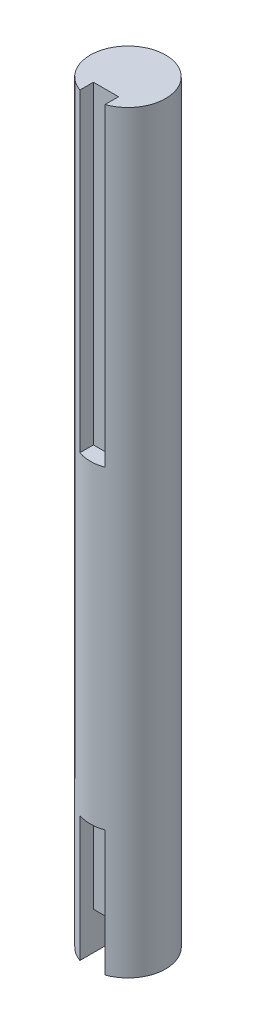
ISO-10303-21;
HEADER;
FILE_DESCRIPTION(('STEP AP214'),'2;1');
FILE_NAME('part.step','',(''),(''),'','','');
FILE_SCHEMA(('AUTOMOTIVE_DESIGN { 1 0 10303 214 1 1 1 1 }'));
ENDSEC;
DATA;
#1=APPLICATION_CONTEXT('core data for automotive mechanical design processes');
#2=APPLICATION_PROTOCOL_DEFINITION('international standard','automotive_design',2000,#1);
#3=PRODUCT_CONTEXT('',#1,'mechanical');
#4=PRODUCT('Part','Part','',(#3));
#5=PRODUCT_RELATED_PRODUCT_CATEGORY('part','',(#4));
#6=PRODUCT_DEFINITION_FORMATION('','',#4);
#7=PRODUCT_DEFINITION_CONTEXT('part definition',#1,'design');
#8=PRODUCT_DEFINITION('design','',#6,#7);
#9=PRODUCT_DEFINITION_SHAPE('','',#8);
#10=(LENGTH_UNIT() NAMED_UNIT(*) SI_UNIT(.MILLI.,.METRE.));
#11=(NAMED_UNIT(*) PLANE_ANGLE_UNIT() SI_UNIT($,.RADIAN.));
#12=(NAMED_UNIT(*) SI_UNIT($,.STERADIAN.) SOLID_ANGLE_UNIT());
#13=UNCERTAINTY_MEASURE_WITH_UNIT(LENGTH_MEASURE(1.E-05),#10,'distance_accuracy_value','');
#14=(GEOMETRIC_REPRESENTATION_CONTEXT(3) GLOBAL_UNCERTAINTY_ASSIGNED_CONTEXT((#13)) GLOBAL_UNIT_ASSIGNED_CONTEXT((#10,
#11,#12)) REPRESENTATION_CONTEXT('',''));
#15=CARTESIAN_POINT('',(0.,0.,0.));
#16=DIRECTION('',(0.,0.,1.));
#17=DIRECTION('',(1.,0.,0.));
#18=AXIS2_PLACEMENT_3D('',#15,#16,#17);
#19=CARTESIAN_POINT('',(0.,-16.,0.));
#20=DIRECTION('',(0.,1.,0.));
#21=DIRECTION('',(0.,0.,1.));
#22=AXIS2_PLACEMENT_3D('',#19,#20,#21);
#23=PLANE('',#22);
#24=DIRECTION('',(0.,0.,1.));
#25=VECTOR('',#24,1.);
#26=CARTESIAN_POINT('',(2.,-16.,0.));
#27=LINE('',#26,#25);
#28=CARTESIAN_POINT('',(2.,-16.,1.));
#29=VERTEX_POINT('',#28);
#30=CARTESIAN_POINT('',(2.,-16.,5.65685424949238));
#31=VERTEX_POINT('',#30);
#32=EDGE_CURVE('E186',#29,#31,#27,.T.);
#33=ORIENTED_EDGE('',*,*,#32,.F.);
#34=DIRECTION('',(-1.,0.,0.));
#35=VECTOR('',#34,1.);
#36=CARTESIAN_POINT('',(0.,-16.,1.));
#37=LINE('',#36,#35);
#38=CARTESIAN_POINT('',(-2.,-16.,0.999999999999999));
#39=VERTEX_POINT('',#38);
#40=EDGE_CURVE('E123',#29,#39,#37,.T.);
#41=ORIENTED_EDGE('',*,*,#40,.T.);
#42=DIRECTION('',(0.,0.,-1.));
#43=VECTOR('',#42,1.);
#44=CARTESIAN_POINT('',(-2.,-16.,0.));
#45=LINE('',#44,#43);
#46=CARTESIAN_POINT('',(-2.,-16.,5.65685424949238));
#47=VERTEX_POINT('',#46);
#48=EDGE_CURVE('E184',#47,#39,#45,.T.);
#49=ORIENTED_EDGE('',*,*,#48,.F.);
#50=CARTESIAN_POINT('',(0.,-16.,0.));
#51=DIRECTION('',(0.,1.,0.));
#52=DIRECTION('',(0.,0.,1.));
#53=AXIS2_PLACEMENT_3D('',#50,#51,#52);
#54=CIRCLE('',#53,6.);
#55=EDGE_CURVE('E181',#31,#47,#54,.T.);
#56=ORIENTED_EDGE('',*,*,#55,.F.);
#57=EDGE_LOOP('',(#33,#41,#49,#56));
#58=FACE_BOUND('',#57,.T.);
#59=ADVANCED_FACE('F38',(#58),#23,.F.);
#60=CARTESIAN_POINT('',(0.,-16.,0.));
#61=DIRECTION('',(0.,1.,0.));
#62=DIRECTION('',(0.,0.,1.));
#63=AXIS2_PLACEMENT_3D('',#60,#61,#62);
#64=CYLINDRICAL_SURFACE('',#63,6.);
#65=CARTESIAN_POINT('',(0.,4.,0.));
#66=DIRECTION('',(0.,1.,0.));
#67=DIRECTION('',(0.,0.,1.));
#68=AXIS2_PLACEMENT_3D('',#65,#66,#67);
#69=CIRCLE('',#68,6.);
#70=CARTESIAN_POINT('',(2.,4.,5.65685424949238));
#71=VERTEX_POINT('',#70);
#72=CARTESIAN_POINT('',(-2.,4.,5.65685424949238));
#73=VERTEX_POINT('',#72);
#74=EDGE_CURVE('E188',#71,#73,#69,.F.);
#75=ORIENTED_EDGE('',*,*,#74,.F.);
#76=DIRECTION('',(0.,1.,0.));
#77=VECTOR('',#76,1.);
#78=CARTESIAN_POINT('',(2.,-16.,5.65685424949238));
#79=LINE('',#78,#77);
#80=EDGE_CURVE('E176',#71,#31,#79,.F.);
#81=ORIENTED_EDGE('',*,*,#80,.T.);
#82=ORIENTED_EDGE('',*,*,#55,.T.);
#83=DIRECTION('',(0.,1.,0.));
#84=VECTOR('',#83,1.);
#85=CARTESIAN_POINT('',(-2.,-16.,5.65685424949238));
#86=LINE('',#85,#84);
#87=EDGE_CURVE('E174',#47,#73,#86,.T.);
#88=ORIENTED_EDGE('',*,*,#87,.T.);
#89=EDGE_LOOP('',(#75,#81,#82,#88));
#90=FACE_BOUND('',#89,.T.);
#91=CARTESIAN_POINT('',(0.,54.,0.));
#92=DIRECTION('',(0.,-1.,0.));
#93=DIRECTION('',(0.,0.,-1.));
#94=AXIS2_PLACEMENT_3D('',#91,#92,#93);
#95=CIRCLE('',#94,6.);
#96=CARTESIAN_POINT('',(-2.,54.,5.65685424949238));
#97=VERTEX_POINT('',#96);
#98=CARTESIAN_POINT('',(2.,54.,5.65685424949238));
#99=VERTEX_POINT('',#98);
#100=EDGE_CURVE('E11',#97,#99,#95,.F.);
#101=ORIENTED_EDGE('',*,*,#100,.F.);
#102=DIRECTION('',(0.,1.,0.));
#103=VECTOR('',#102,1.);
#104=CARTESIAN_POINT('',(-2.,-16.,5.65685424949238));
#105=LINE('',#104,#103);
#106=CARTESIAN_POINT('',(-2.,104.,5.65685424949238));
#107=VERTEX_POINT('',#106);
#108=EDGE_CURVE('E160',#97,#107,#105,.T.);
#109=ORIENTED_EDGE('',*,*,#108,.T.);
#110=CARTESIAN_POINT('',(0.,104.,0.));
#111=DIRECTION('',(0.,1.,0.));
#112=DIRECTION('',(0.,0.,1.));
#113=AXIS2_PLACEMENT_3D('',#110,#111,#112);
#114=CIRCLE('',#113,6.);
#115=CARTESIAN_POINT('',(2.,104.,5.65685424949238));
#116=VERTEX_POINT('',#115);
#117=EDGE_CURVE('E178',#116,#107,#114,.T.);
#118=ORIENTED_EDGE('',*,*,#117,.F.);
#119=DIRECTION('',(0.,1.,0.));
#120=VECTOR('',#119,1.);
#121=CARTESIAN_POINT('',(2.,-16.,5.65685424949238));
#122=LINE('',#121,#120);
#123=EDGE_CURVE('E61',#116,#99,#122,.F.);
#124=ORIENTED_EDGE('',*,*,#123,.T.);
#125=EDGE_LOOP('',(#101,#109,#118,#124));
#126=FACE_BOUND('',#125,.T.);
#127=ADVANCED_FACE('F40',(#90,#126),#64,.T.);
#128=CARTESIAN_POINT('',(0.,104.,0.));
#129=DIRECTION('',(0.,1.,0.));
#130=DIRECTION('',(0.,0.,1.));
#131=AXIS2_PLACEMENT_3D('',#128,#129,#130);
#132=PLANE('',#131);
#133=ORIENTED_EDGE('',*,*,#117,.T.);
#134=DIRECTION('',(0.,0.,-1.));
#135=VECTOR('',#134,1.);
#136=CARTESIAN_POINT('',(-2.,104.,0.));
#137=LINE('',#136,#135);
#138=CARTESIAN_POINT('',(-2.,104.,3.5));
#139=VERTEX_POINT('',#138);
#140=EDGE_CURVE('E46',#107,#139,#137,.T.);
#141=ORIENTED_EDGE('',*,*,#140,.T.);
#142=DIRECTION('',(1.,0.,0.));
#143=VECTOR('',#142,1.);
#144=CARTESIAN_POINT('',(0.,104.,3.5));
#145=LINE('',#144,#143);
#146=CARTESIAN_POINT('',(2.,104.,3.5));
#147=VERTEX_POINT('',#146);
#148=EDGE_CURVE('E139',#139,#147,#145,.T.);
#149=ORIENTED_EDGE('',*,*,#148,.T.);
#150=DIRECTION('',(0.,0.,1.));
#151=VECTOR('',#150,1.);
#152=CARTESIAN_POINT('',(2.,104.,0.));
#153=LINE('',#152,#151);
#154=EDGE_CURVE('E147',#147,#116,#153,.T.);
#155=ORIENTED_EDGE('',*,*,#154,.T.);
#156=EDGE_LOOP('',(#133,#141,#149,#155));
#157=FACE_BOUND('',#156,.T.);
#158=ADVANCED_FACE('F192',(#157),#132,.T.);
#159=CARTESIAN_POINT('',(0.,4.,3.5));
#160=DIRECTION('',(0.,0.,1.));
#161=DIRECTION('',(1.,0.,0.));
#162=AXIS2_PLACEMENT_3D('',#159,#160,#161);
#163=PLANE('',#162);
#164=DIRECTION('',(-1.,0.,0.));
#165=VECTOR('',#164,1.);
#166=CARTESIAN_POINT('',(0.,-10.,3.5));
#167=LINE('',#166,#165);
#168=CARTESIAN_POINT('',(2.,-10.,3.5));
#169=VERTEX_POINT('',#168);
#170=CARTESIAN_POINT('',(-2.,-10.,3.5));
#171=VERTEX_POINT('',#170);
#172=EDGE_CURVE('E136',#169,#171,#167,.T.);
#173=ORIENTED_EDGE('',*,*,#172,.F.);
#174=DIRECTION('',(0.,-1.,0.));
#175=VECTOR('',#174,1.);
#176=CARTESIAN_POINT('',(2.,4.,3.5));
#177=LINE('',#176,#175);
#178=CARTESIAN_POINT('',(2.,4.,3.5));
#179=VERTEX_POINT('',#178);
#180=EDGE_CURVE('E121',#179,#169,#177,.T.);
#181=ORIENTED_EDGE('',*,*,#180,.F.);
#182=DIRECTION('',(-1.,0.,0.));
#183=VECTOR('',#182,1.);
#184=CARTESIAN_POINT('',(0.,4.,3.5));
#185=LINE('',#184,#183);
#186=CARTESIAN_POINT('',(-2.,4.,3.5));
#187=VERTEX_POINT('',#186);
#188=EDGE_CURVE('E165',#179,#187,#185,.T.);
#189=ORIENTED_EDGE('',*,*,#188,.T.);
#190=DIRECTION('',(0.,-1.,0.));
#191=VECTOR('',#190,1.);
#192=CARTESIAN_POINT('',(-2.,4.,3.5));
#193=LINE('',#192,#191);
#194=EDGE_CURVE('E170',#187,#171,#193,.T.);
#195=ORIENTED_EDGE('',*,*,#194,.T.);
#196=EDGE_LOOP('',(#173,#181,#189,#195));
#197=FACE_BOUND('',#196,.T.);
#198=ADVANCED_FACE('F226',(#197),#163,.T.);
#199=CARTESIAN_POINT('',(2.,4.,0.));
#200=DIRECTION('',(-1.,0.,0.));
#201=DIRECTION('',(0.,0.,1.));
#202=AXIS2_PLACEMENT_3D('',#199,#200,#201);
#203=PLANE('',#202);
#204=ORIENTED_EDGE('',*,*,#180,.T.);
#205=DIRECTION('',(0.,0.,-1.));
#206=VECTOR('',#205,1.);
#207=CARTESIAN_POINT('',(2.,-10.,0.));
#208=LINE('',#207,#206);
#209=CARTESIAN_POINT('',(2.,-10.,1.));
#210=VERTEX_POINT('',#209);
#211=EDGE_CURVE('E53',#169,#210,#208,.T.);
#212=ORIENTED_EDGE('',*,*,#211,.T.);
#213=DIRECTION('',(0.,-1.,0.));
#214=VECTOR('',#213,1.);
#215=CARTESIAN_POINT('',(2.,-10.,1.));
#216=LINE('',#215,#214);
#217=EDGE_CURVE('E119',#210,#29,#216,.T.);
#218=ORIENTED_EDGE('',*,*,#217,.T.);
#219=ORIENTED_EDGE('',*,*,#32,.T.);
#220=ORIENTED_EDGE('',*,*,#80,.F.);
#221=DIRECTION('',(0.,0.,-1.));
#222=VECTOR('',#221,1.);
#223=CARTESIAN_POINT('',(2.,4.,0.));
#224=LINE('',#223,#222);
#225=EDGE_CURVE('E163',#71,#179,#224,.T.);
#226=ORIENTED_EDGE('',*,*,#225,.T.);
#227=EDGE_LOOP('',(#204,#212,#218,#219,#220,#226));
#228=FACE_BOUND('',#227,.T.);
#229=ADVANCED_FACE('F116',(#228),#203,.T.);
#230=CARTESIAN_POINT('',(-2.,4.,0.));
#231=DIRECTION('',(1.,0.,0.));
#232=DIRECTION('',(0.,0.,-1.));
#233=AXIS2_PLACEMENT_3D('',#230,#231,#232);
#234=PLANE('',#233);
#235=DIRECTION('',(0.,0.,1.));
#236=VECTOR('',#235,1.);
#237=CARTESIAN_POINT('',(-2.,4.,0.));
#238=LINE('',#237,#236);
#239=EDGE_CURVE('E167',#187,#73,#238,.T.);
#240=ORIENTED_EDGE('',*,*,#239,.T.);
#241=ORIENTED_EDGE('',*,*,#87,.F.);
#242=ORIENTED_EDGE('',*,*,#48,.T.);
#243=DIRECTION('',(0.,-1.,0.));
#244=VECTOR('',#243,1.);
#245=CARTESIAN_POINT('',(-2.,-10.,0.999999999999999));
#246=LINE('',#245,#244);
#247=CARTESIAN_POINT('',(-2.,-10.,0.999999999999999));
#248=VERTEX_POINT('',#247);
#249=EDGE_CURVE('E137',#248,#39,#246,.T.);
#250=ORIENTED_EDGE('',*,*,#249,.F.);
#251=DIRECTION('',(0.,0.,1.));
#252=VECTOR('',#251,1.);
#253=CARTESIAN_POINT('',(-2.,-10.,0.));
#254=LINE('',#253,#252);
#255=EDGE_CURVE('E128',#248,#171,#254,.T.);
#256=ORIENTED_EDGE('',*,*,#255,.T.);
#257=ORIENTED_EDGE('',*,*,#194,.F.);
#258=EDGE_LOOP('',(#240,#241,#242,#250,#256,#257));
#259=FACE_BOUND('',#258,.T.);
#260=ADVANCED_FACE('F229',(#259),#234,.T.);
#261=CARTESIAN_POINT('',(0.,4.,0.));
#262=DIRECTION('',(0.,1.,0.));
#263=DIRECTION('',(0.,0.,1.));
#264=AXIS2_PLACEMENT_3D('',#261,#262,#263);
#265=PLANE('',#264);
#266=ORIENTED_EDGE('',*,*,#74,.T.);
#267=ORIENTED_EDGE('',*,*,#239,.F.);
#268=ORIENTED_EDGE('',*,*,#188,.F.);
#269=ORIENTED_EDGE('',*,*,#225,.F.);
#270=EDGE_LOOP('',(#266,#267,#268,#269));
#271=FACE_BOUND('',#270,.T.);
#272=ADVANCED_FACE('F215',(#271),#265,.F.);
#273=CARTESIAN_POINT('',(-2.,54.,0.));
#274=DIRECTION('',(1.,0.,0.));
#275=DIRECTION('',(0.,0.,-1.));
#276=AXIS2_PLACEMENT_3D('',#273,#274,#275);
#277=PLANE('',#276);
#278=DIRECTION('',(0.,0.,-1.));
#279=VECTOR('',#278,1.);
#280=CARTESIAN_POINT('',(-2.,54.,0.));
#281=LINE('',#280,#279);
#282=CARTESIAN_POINT('',(-2.,54.,3.5));
#283=VERTEX_POINT('',#282);
#284=EDGE_CURVE('E144',#97,#283,#281,.T.);
#285=ORIENTED_EDGE('',*,*,#284,.T.);
#286=DIRECTION('',(0.,1.,0.));
#287=VECTOR('',#286,1.);
#288=CARTESIAN_POINT('',(-2.,54.,3.5));
#289=LINE('',#288,#287);
#290=EDGE_CURVE('E156',#283,#139,#289,.T.);
#291=ORIENTED_EDGE('',*,*,#290,.T.);
#292=ORIENTED_EDGE('',*,*,#140,.F.);
#293=ORIENTED_EDGE('',*,*,#108,.F.);
#294=EDGE_LOOP('',(#285,#291,#292,#293));
#295=FACE_BOUND('',#294,.T.);
#296=ADVANCED_FACE('F195',(#295),#277,.T.);
#297=CARTESIAN_POINT('',(0.,54.,3.5));
#298=DIRECTION('',(0.,0.,1.));
#299=DIRECTION('',(1.,0.,0.));
#300=AXIS2_PLACEMENT_3D('',#297,#298,#299);
#301=PLANE('',#300);
#302=ORIENTED_EDGE('',*,*,#148,.F.);
#303=ORIENTED_EDGE('',*,*,#290,.F.);
#304=DIRECTION('',(1.,0.,0.));
#305=VECTOR('',#304,1.);
#306=CARTESIAN_POINT('',(0.,54.,3.5));
#307=LINE('',#306,#305);
#308=CARTESIAN_POINT('',(2.,54.,3.5));
#309=VERTEX_POINT('',#308);
#310=EDGE_CURVE('E146',#283,#309,#307,.T.);
#311=ORIENTED_EDGE('',*,*,#310,.T.);
#312=DIRECTION('',(0.,1.,0.));
#313=VECTOR('',#312,1.);
#314=CARTESIAN_POINT('',(2.,54.,3.5));
#315=LINE('',#314,#313);
#316=EDGE_CURVE('E151',#309,#147,#315,.T.);
#317=ORIENTED_EDGE('',*,*,#316,.T.);
#318=EDGE_LOOP('',(#302,#303,#311,#317));
#319=FACE_BOUND('',#318,.T.);
#320=ADVANCED_FACE('F207',(#319),#301,.T.);
#321=CARTESIAN_POINT('',(2.,54.,0.));
#322=DIRECTION('',(-1.,0.,0.));
#323=DIRECTION('',(0.,0.,1.));
#324=AXIS2_PLACEMENT_3D('',#321,#322,#323);
#325=PLANE('',#324);
#326=ORIENTED_EDGE('',*,*,#154,.F.);
#327=ORIENTED_EDGE('',*,*,#316,.F.);
#328=DIRECTION('',(0.,0.,1.));
#329=VECTOR('',#328,1.);
#330=CARTESIAN_POINT('',(2.,54.,0.));
#331=LINE('',#330,#329);
#332=EDGE_CURVE('E149',#309,#99,#331,.T.);
#333=ORIENTED_EDGE('',*,*,#332,.T.);
#334=ORIENTED_EDGE('',*,*,#123,.F.);
#335=EDGE_LOOP('',(#326,#327,#333,#334));
#336=FACE_BOUND('',#335,.T.);
#337=ADVANCED_FACE('F205',(#336),#325,.T.);
#338=CARTESIAN_POINT('',(0.,54.,0.));
#339=DIRECTION('',(0.,-1.,0.));
#340=DIRECTION('',(0.,0.,-1.));
#341=AXIS2_PLACEMENT_3D('',#338,#339,#340);
#342=PLANE('',#341);
#343=ORIENTED_EDGE('',*,*,#100,.T.);
#344=ORIENTED_EDGE('',*,*,#332,.F.);
#345=ORIENTED_EDGE('',*,*,#310,.F.);
#346=ORIENTED_EDGE('',*,*,#284,.F.);
#347=EDGE_LOOP('',(#343,#344,#345,#346));
#348=FACE_BOUND('',#347,.T.);
#349=ADVANCED_FACE('F202',(#348),#342,.F.);
#350=CARTESIAN_POINT('',(0.,-10.,1.));
#351=DIRECTION('',(0.,0.,1.));
#352=DIRECTION('',(1.,0.,0.));
#353=AXIS2_PLACEMENT_3D('',#350,#351,#352);
#354=PLANE('',#353);
#355=ORIENTED_EDGE('',*,*,#40,.F.);
#356=ORIENTED_EDGE('',*,*,#217,.F.);
#357=DIRECTION('',(-1.,0.,0.));
#358=VECTOR('',#357,1.);
#359=CARTESIAN_POINT('',(0.,-10.,1.));
#360=LINE('',#359,#358);
#361=EDGE_CURVE('E122',#210,#248,#360,.T.);
#362=ORIENTED_EDGE('',*,*,#361,.T.);
#363=ORIENTED_EDGE('',*,*,#249,.T.);
#364=EDGE_LOOP('',(#355,#356,#362,#363));
#365=FACE_BOUND('',#364,.T.);
#366=ADVANCED_FACE('F134',(#365),#354,.T.);
#367=CARTESIAN_POINT('',(0.,-10.,0.));
#368=DIRECTION('',(0.,1.,0.));
#369=DIRECTION('',(0.,0.,1.));
#370=AXIS2_PLACEMENT_3D('',#367,#368,#369);
#371=PLANE('',#370);
#372=ORIENTED_EDGE('',*,*,#172,.T.);
#373=ORIENTED_EDGE('',*,*,#255,.F.);
#374=ORIENTED_EDGE('',*,*,#361,.F.);
#375=ORIENTED_EDGE('',*,*,#211,.F.);
#376=EDGE_LOOP('',(#372,#373,#374,#375));
#377=FACE_BOUND('',#376,.T.);
#378=ADVANCED_FACE('F126',(#377),#371,.F.);
#379=CLOSED_SHELL('',(#59,#127,#158,#198,#229,#260,#272,#296,#320,#337,#349,#366,#378));
#380=MANIFOLD_SOLID_BREP('B2',#379);
#381=ADVANCED_BREP_SHAPE_REPRESENTATION('',(#18,#380),#14);
#382=SHAPE_DEFINITION_REPRESENTATION(#9,#381);
ENDSEC;
END-ISO-10303-21;
